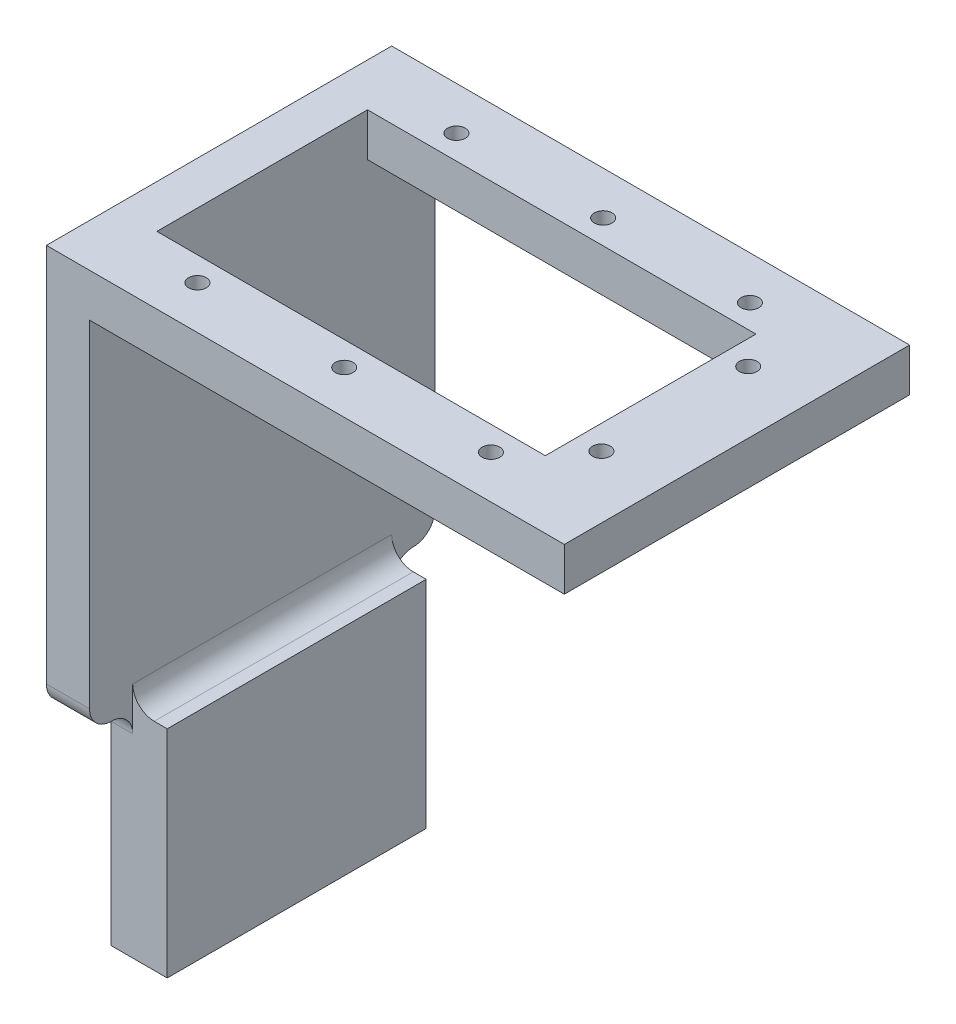
ISO-10303-21;
HEADER;
FILE_DESCRIPTION(('STEP AP214'),'2;1');
FILE_NAME('part.step','',(''),(''),'','','');
FILE_SCHEMA(('AUTOMOTIVE_DESIGN { 1 0 10303 214 1 1 1 1 }'));
ENDSEC;
DATA;
#1=APPLICATION_CONTEXT('core data for automotive mechanical design processes');
#2=APPLICATION_PROTOCOL_DEFINITION('international standard','automotive_design',2000,#1);
#3=PRODUCT_CONTEXT('',#1,'mechanical');
#4=PRODUCT('Part','Part','',(#3));
#5=PRODUCT_RELATED_PRODUCT_CATEGORY('part','',(#4));
#6=PRODUCT_DEFINITION_FORMATION('','',#4);
#7=PRODUCT_DEFINITION_CONTEXT('part definition',#1,'design');
#8=PRODUCT_DEFINITION('design','',#6,#7);
#9=PRODUCT_DEFINITION_SHAPE('','',#8);
#10=(LENGTH_UNIT() NAMED_UNIT(*) SI_UNIT(.MILLI.,.METRE.));
#11=(NAMED_UNIT(*) PLANE_ANGLE_UNIT() SI_UNIT($,.RADIAN.));
#12=(NAMED_UNIT(*) SI_UNIT($,.STERADIAN.) SOLID_ANGLE_UNIT());
#13=UNCERTAINTY_MEASURE_WITH_UNIT(LENGTH_MEASURE(1.E-05),#10,'distance_accuracy_value','');
#14=(GEOMETRIC_REPRESENTATION_CONTEXT(3) GLOBAL_UNCERTAINTY_ASSIGNED_CONTEXT((#13)) GLOBAL_UNIT_ASSIGNED_CONTEXT((#10,
#11,#12)) REPRESENTATION_CONTEXT('',''));
#15=CARTESIAN_POINT('',(0.,0.,0.));
#16=DIRECTION('',(0.,0.,1.));
#17=DIRECTION('',(1.,0.,0.));
#18=AXIS2_PLACEMENT_3D('',#15,#16,#17);
#19=CARTESIAN_POINT('',(0.,5.,0.));
#20=DIRECTION('',(0.,-1.,0.));
#21=DIRECTION('',(0.,0.,-1.));
#22=AXIS2_PLACEMENT_3D('',#19,#20,#21);
#23=PLANE('',#22);
#24=CARTESIAN_POINT('',(46.5,5.,-35.));
#25=DIRECTION('',(0.,-1.,0.));
#26=DIRECTION('',(0.,0.,-1.));
#27=AXIS2_PLACEMENT_3D('',#24,#25,#26);
#28=CIRCLE('',#27,1.025);
#29=CARTESIAN_POINT('',(46.5,5.,-36.025));
#30=VERTEX_POINT('',#29);
#31=EDGE_CURVE('E321',#30,#30,#28,.F.);
#32=ORIENTED_EDGE('',*,*,#31,.F.);
#33=EDGE_LOOP('',(#32));
#34=FACE_BOUND('',#33,.T.);
#35=CARTESIAN_POINT('',(29.5,5.,-35.));
#36=DIRECTION('',(0.,-1.,0.));
#37=DIRECTION('',(0.,0.,-1.));
#38=AXIS2_PLACEMENT_3D('',#35,#36,#37);
#39=CIRCLE('',#38,1.025);
#40=CARTESIAN_POINT('',(29.5,5.,-36.025));
#41=VERTEX_POINT('',#40);
#42=EDGE_CURVE('E506',#41,#41,#39,.F.);
#43=ORIENTED_EDGE('',*,*,#42,.F.);
#44=EDGE_LOOP('',(#43));
#45=FACE_BOUND('',#44,.T.);
#46=CARTESIAN_POINT('',(12.5,5.,-35.));
#47=DIRECTION('',(0.,-1.,0.));
#48=DIRECTION('',(0.,0.,-1.));
#49=AXIS2_PLACEMENT_3D('',#46,#47,#48);
#50=CIRCLE('',#49,1.02499999999999);
#51=CARTESIAN_POINT('',(12.5,5.,-36.025));
#52=VERTEX_POINT('',#51);
#53=EDGE_CURVE('E512',#52,#52,#50,.F.);
#54=ORIENTED_EDGE('',*,*,#53,.F.);
#55=EDGE_LOOP('',(#54));
#56=FACE_BOUND('',#55,.T.);
#57=CARTESIAN_POINT('',(12.5,5.,-4.9999999999998));
#58=DIRECTION('',(0.,-1.,0.));
#59=DIRECTION('',(0.,0.,-1.));
#60=AXIS2_PLACEMENT_3D('',#57,#58,#59);
#61=CIRCLE('',#60,1.02499999999999);
#62=CARTESIAN_POINT('',(12.5,5.,-6.02499999999979));
#63=VERTEX_POINT('',#62);
#64=EDGE_CURVE('E487',#63,#63,#61,.F.);
#65=ORIENTED_EDGE('',*,*,#64,.F.);
#66=EDGE_LOOP('',(#65));
#67=FACE_BOUND('',#66,.T.);
#68=CARTESIAN_POINT('',(29.5,5.,-4.99999999999978));
#69=DIRECTION('',(0.,-1.,0.));
#70=DIRECTION('',(0.,0.,-1.));
#71=AXIS2_PLACEMENT_3D('',#68,#69,#70);
#72=CIRCLE('',#71,1.025);
#73=CARTESIAN_POINT('',(29.5,5.,-6.02499999999978));
#74=VERTEX_POINT('',#73);
#75=EDGE_CURVE('E482',#74,#74,#72,.F.);
#76=ORIENTED_EDGE('',*,*,#75,.F.);
#77=EDGE_LOOP('',(#76));
#78=FACE_BOUND('',#77,.T.);
#79=CARTESIAN_POINT('',(46.5,5.,-4.99999999999978));
#80=DIRECTION('',(0.,-1.,0.));
#81=DIRECTION('',(0.,0.,-1.));
#82=AXIS2_PLACEMENT_3D('',#79,#80,#81);
#83=CIRCLE('',#82,1.025);
#84=CARTESIAN_POINT('',(46.5,5.,-6.02499999999977));
#85=VERTEX_POINT('',#84);
#86=EDGE_CURVE('E489',#85,#85,#83,.F.);
#87=ORIENTED_EDGE('',*,*,#86,.F.);
#88=EDGE_LOOP('',(#87));
#89=FACE_BOUND('',#88,.T.);
#90=CARTESIAN_POINT('',(52.8,5.,-11.4999999999998));
#91=DIRECTION('',(0.,-1.,0.));
#92=DIRECTION('',(0.,0.,-1.));
#93=AXIS2_PLACEMENT_3D('',#90,#91,#92);
#94=CIRCLE('',#93,1.025);
#95=CARTESIAN_POINT('',(52.8,5.,-12.5249999999998));
#96=VERTEX_POINT('',#95);
#97=EDGE_CURVE('E495',#96,#96,#94,.F.);
#98=ORIENTED_EDGE('',*,*,#97,.F.);
#99=EDGE_LOOP('',(#98));
#100=FACE_BOUND('',#99,.T.);
#101=CARTESIAN_POINT('',(52.8,5.,-28.5));
#102=DIRECTION('',(0.,-1.,0.));
#103=DIRECTION('',(0.,0.,-1.));
#104=AXIS2_PLACEMENT_3D('',#101,#102,#103);
#105=CIRCLE('',#104,1.025);
#106=CARTESIAN_POINT('',(52.8,5.,-29.525));
#107=VERTEX_POINT('',#106);
#108=EDGE_CURVE('E310',#107,#107,#105,.F.);
#109=ORIENTED_EDGE('',*,*,#108,.F.);
#110=EDGE_LOOP('',(#109));
#111=FACE_BOUND('',#110,.T.);
#112=DIRECTION('',(0.,0.,1.));
#113=VECTOR('',#112,1.);
#114=CARTESIAN_POINT('',(0.,5.,0.));
#115=LINE('',#114,#113);
#116=CARTESIAN_POINT('',(0.,5.,-40.));
#117=VERTEX_POINT('',#116);
#118=CARTESIAN_POINT('',(0.,5.,0.));
#119=VERTEX_POINT('',#118);
#120=EDGE_CURVE('E236',#117,#119,#115,.T.);
#121=ORIENTED_EDGE('',*,*,#120,.T.);
#122=DIRECTION('',(1.,0.,0.));
#123=VECTOR('',#122,1.);
#124=CARTESIAN_POINT('',(0.,5.,0.));
#125=LINE('',#124,#123);
#126=CARTESIAN_POINT('',(60.,5.,0.));
#127=VERTEX_POINT('',#126);
#128=EDGE_CURVE('E239',#119,#127,#125,.T.);
#129=ORIENTED_EDGE('',*,*,#128,.T.);
#130=DIRECTION('',(0.,0.,-1.));
#131=VECTOR('',#130,1.);
#132=CARTESIAN_POINT('',(60.,5.,0.));
#133=LINE('',#132,#131);
#134=CARTESIAN_POINT('',(60.,5.,-40.));
#135=VERTEX_POINT('',#134);
#136=EDGE_CURVE('E242',#127,#135,#133,.T.);
#137=ORIENTED_EDGE('',*,*,#136,.T.);
#138=DIRECTION('',(-1.,0.,0.));
#139=VECTOR('',#138,1.);
#140=CARTESIAN_POINT('',(0.,5.,-40.));
#141=LINE('',#140,#139);
#142=EDGE_CURVE('E244',#135,#117,#141,.T.);
#143=ORIENTED_EDGE('',*,*,#142,.T.);
#144=EDGE_LOOP('',(#121,#129,#137,#143));
#145=FACE_BOUND('',#144,.T.);
#146=DIRECTION('',(0.,0.,1.));
#147=VECTOR('',#146,1.);
#148=CARTESIAN_POINT('',(5.,5.,-7.8));
#149=LINE('',#148,#147);
#150=CARTESIAN_POINT('',(5.,5.,-32.2));
#151=VERTEX_POINT('',#150);
#152=CARTESIAN_POINT('',(5.,5.,-7.8));
#153=VERTEX_POINT('',#152);
#154=EDGE_CURVE('E209',#151,#153,#149,.T.);
#155=ORIENTED_EDGE('',*,*,#154,.F.);
#156=DIRECTION('',(-1.,0.,0.));
#157=VECTOR('',#156,1.);
#158=CARTESIAN_POINT('',(5.,5.,-32.2));
#159=LINE('',#158,#157);
#160=CARTESIAN_POINT('',(50.,5.,-32.2));
#161=VERTEX_POINT('',#160);
#162=EDGE_CURVE('E217',#161,#151,#159,.T.);
#163=ORIENTED_EDGE('',*,*,#162,.F.);
#164=DIRECTION('',(0.,0.,-1.));
#165=VECTOR('',#164,1.);
#166=CARTESIAN_POINT('',(50.,5.,-7.8));
#167=LINE('',#166,#165);
#168=CARTESIAN_POINT('',(50.,5.,-7.8));
#169=VERTEX_POINT('',#168);
#170=EDGE_CURVE('E214',#169,#161,#167,.T.);
#171=ORIENTED_EDGE('',*,*,#170,.F.);
#172=DIRECTION('',(1.,0.,0.));
#173=VECTOR('',#172,1.);
#174=CARTESIAN_POINT('',(5.,5.,-7.8));
#175=LINE('',#174,#173);
#176=EDGE_CURVE('E211',#153,#169,#175,.T.);
#177=ORIENTED_EDGE('',*,*,#176,.F.);
#178=EDGE_LOOP('',(#155,#163,#171,#177));
#179=FACE_BOUND('',#178,.T.);
#180=ADVANCED_FACE('F39',(#34,#45,#56,#67,#78,#89,#100,#111,#145,#179),#23,.F.);
#181=CARTESIAN_POINT('',(0.,0.,0.));
#182=DIRECTION('',(0.,-1.,0.));
#183=DIRECTION('',(0.,0.,-1.));
#184=AXIS2_PLACEMENT_3D('',#181,#182,#183);
#185=PLANE('',#184);
#186=CARTESIAN_POINT('',(46.5,0.,-35.));
#187=DIRECTION('',(0.,-1.,0.));
#188=DIRECTION('',(0.,0.,-1.));
#189=AXIS2_PLACEMENT_3D('',#186,#187,#188);
#190=CIRCLE('',#189,1.025);
#191=CARTESIAN_POINT('',(46.5,0.,-36.025));
#192=VERTEX_POINT('',#191);
#193=EDGE_CURVE('E503',#192,#192,#190,.T.);
#194=ORIENTED_EDGE('',*,*,#193,.F.);
#195=EDGE_LOOP('',(#194));
#196=FACE_BOUND('',#195,.T.);
#197=CARTESIAN_POINT('',(29.5,0.,-35.));
#198=DIRECTION('',(0.,-1.,0.));
#199=DIRECTION('',(0.,0.,-1.));
#200=AXIS2_PLACEMENT_3D('',#197,#198,#199);
#201=CIRCLE('',#200,1.025);
#202=CARTESIAN_POINT('',(29.5,0.,-36.025));
#203=VERTEX_POINT('',#202);
#204=EDGE_CURVE('E509',#203,#203,#201,.T.);
#205=ORIENTED_EDGE('',*,*,#204,.F.);
#206=EDGE_LOOP('',(#205));
#207=FACE_BOUND('',#206,.T.);
#208=CARTESIAN_POINT('',(12.5,0.,-35.));
#209=DIRECTION('',(0.,-1.,0.));
#210=DIRECTION('',(0.,0.,-1.));
#211=AXIS2_PLACEMENT_3D('',#208,#209,#210);
#212=CIRCLE('',#211,1.02499999999999);
#213=CARTESIAN_POINT('',(12.5,0.,-36.025));
#214=VERTEX_POINT('',#213);
#215=EDGE_CURVE('E515',#214,#214,#212,.T.);
#216=ORIENTED_EDGE('',*,*,#215,.F.);
#217=EDGE_LOOP('',(#216));
#218=FACE_BOUND('',#217,.T.);
#219=CARTESIAN_POINT('',(12.5,0.,-4.9999999999998));
#220=DIRECTION('',(0.,-1.,0.));
#221=DIRECTION('',(0.,0.,1.));
#222=AXIS2_PLACEMENT_3D('',#219,#220,#221);
#223=CIRCLE('',#222,1.02499999999999);
#224=CARTESIAN_POINT('',(12.5,0.,-3.9749999999998));
#225=VERTEX_POINT('',#224);
#226=EDGE_CURVE('E484',#225,#225,#223,.T.);
#227=ORIENTED_EDGE('',*,*,#226,.F.);
#228=EDGE_LOOP('',(#227));
#229=FACE_BOUND('',#228,.T.);
#230=CARTESIAN_POINT('',(29.5,0.,-4.99999999999978));
#231=DIRECTION('',(0.,-1.,0.));
#232=DIRECTION('',(0.,0.,1.));
#233=AXIS2_PLACEMENT_3D('',#230,#231,#232);
#234=CIRCLE('',#233,1.025);
#235=CARTESIAN_POINT('',(29.5,0.,-3.97499999999979));
#236=VERTEX_POINT('',#235);
#237=EDGE_CURVE('E479',#236,#236,#234,.T.);
#238=ORIENTED_EDGE('',*,*,#237,.F.);
#239=EDGE_LOOP('',(#238));
#240=FACE_BOUND('',#239,.T.);
#241=CARTESIAN_POINT('',(46.5,0.,-4.99999999999978));
#242=DIRECTION('',(0.,-1.,0.));
#243=DIRECTION('',(0.,0.,1.));
#244=AXIS2_PLACEMENT_3D('',#241,#242,#243);
#245=CIRCLE('',#244,1.025);
#246=CARTESIAN_POINT('',(46.5,0.,-3.97499999999978));
#247=VERTEX_POINT('',#246);
#248=EDGE_CURVE('E492',#247,#247,#245,.T.);
#249=ORIENTED_EDGE('',*,*,#248,.F.);
#250=EDGE_LOOP('',(#249));
#251=FACE_BOUND('',#250,.T.);
#252=CARTESIAN_POINT('',(52.8,0.,-11.4999999999998));
#253=DIRECTION('',(0.,-1.,0.));
#254=DIRECTION('',(0.,0.,1.));
#255=AXIS2_PLACEMENT_3D('',#252,#253,#254);
#256=CIRCLE('',#255,1.025);
#257=CARTESIAN_POINT('',(52.8,0.,-10.4749999999998));
#258=VERTEX_POINT('',#257);
#259=EDGE_CURVE('E498',#258,#258,#256,.T.);
#260=ORIENTED_EDGE('',*,*,#259,.F.);
#261=EDGE_LOOP('',(#260));
#262=FACE_BOUND('',#261,.T.);
#263=CARTESIAN_POINT('',(52.8,0.,-28.5));
#264=DIRECTION('',(0.,-1.,0.));
#265=DIRECTION('',(0.,0.,-1.));
#266=AXIS2_PLACEMENT_3D('',#263,#264,#265);
#267=CIRCLE('',#266,1.025);
#268=CARTESIAN_POINT('',(52.8,0.,-29.525));
#269=VERTEX_POINT('',#268);
#270=EDGE_CURVE('E316',#269,#269,#267,.T.);
#271=ORIENTED_EDGE('',*,*,#270,.F.);
#272=EDGE_LOOP('',(#271));
#273=FACE_BOUND('',#272,.T.);
#274=DIRECTION('',(0.,0.,1.));
#275=VECTOR('',#274,1.);
#276=CARTESIAN_POINT('',(5.,0.,-40.));
#277=LINE('',#276,#275);
#278=CARTESIAN_POINT('',(5.,0.,-40.));
#279=VERTEX_POINT('',#278);
#280=CARTESIAN_POINT('',(5.,0.,-32.2));
#281=VERTEX_POINT('',#280);
#282=EDGE_CURVE('E194',#279,#281,#277,.T.);
#283=ORIENTED_EDGE('',*,*,#282,.F.);
#284=DIRECTION('',(-1.,0.,0.));
#285=VECTOR('',#284,1.);
#286=CARTESIAN_POINT('',(0.,0.,-40.));
#287=LINE('',#286,#285);
#288=CARTESIAN_POINT('',(60.,0.,-40.));
#289=VERTEX_POINT('',#288);
#290=EDGE_CURVE('E240',#289,#279,#287,.T.);
#291=ORIENTED_EDGE('',*,*,#290,.F.);
#292=DIRECTION('',(0.,0.,-1.));
#293=VECTOR('',#292,1.);
#294=CARTESIAN_POINT('',(60.,0.,0.));
#295=LINE('',#294,#293);
#296=CARTESIAN_POINT('',(60.,0.,0.));
#297=VERTEX_POINT('',#296);
#298=EDGE_CURVE('E248',#297,#289,#295,.T.);
#299=ORIENTED_EDGE('',*,*,#298,.F.);
#300=DIRECTION('',(1.,0.,0.));
#301=VECTOR('',#300,1.);
#302=CARTESIAN_POINT('',(0.,0.,0.));
#303=LINE('',#302,#301);
#304=CARTESIAN_POINT('',(5.,0.,0.));
#305=VERTEX_POINT('',#304);
#306=EDGE_CURVE('E235',#305,#297,#303,.T.);
#307=ORIENTED_EDGE('',*,*,#306,.F.);
#308=CARTESIAN_POINT('',(5.,0.,-7.8));
#309=VERTEX_POINT('',#308);
#310=EDGE_CURVE('E198',#309,#305,#277,.T.);
#311=ORIENTED_EDGE('',*,*,#310,.F.);
#312=DIRECTION('',(1.,0.,0.));
#313=VECTOR('',#312,1.);
#314=CARTESIAN_POINT('',(5.,0.,-7.8));
#315=LINE('',#314,#313);
#316=CARTESIAN_POINT('',(50.,0.,-7.8));
#317=VERTEX_POINT('',#316);
#318=EDGE_CURVE('E208',#309,#317,#315,.T.);
#319=ORIENTED_EDGE('',*,*,#318,.T.);
#320=DIRECTION('',(0.,0.,-1.));
#321=VECTOR('',#320,1.);
#322=CARTESIAN_POINT('',(50.,0.,-7.8));
#323=LINE('',#322,#321);
#324=CARTESIAN_POINT('',(50.,0.,-32.2));
#325=VERTEX_POINT('',#324);
#326=EDGE_CURVE('E222',#317,#325,#323,.T.);
#327=ORIENTED_EDGE('',*,*,#326,.T.);
#328=DIRECTION('',(-1.,0.,0.));
#329=VECTOR('',#328,1.);
#330=CARTESIAN_POINT('',(5.,0.,-32.2));
#331=LINE('',#330,#329);
#332=EDGE_CURVE('E212',#325,#281,#331,.T.);
#333=ORIENTED_EDGE('',*,*,#332,.T.);
#334=EDGE_LOOP('',(#283,#291,#299,#307,#311,#319,#327,#333));
#335=FACE_BOUND('',#334,.T.);
#336=ADVANCED_FACE('F378',(#196,#207,#218,#229,#240,#251,#262,#273,#335),#185,.T.);
#337=CARTESIAN_POINT('',(0.,5.,0.));
#338=DIRECTION('',(1.,0.,0.));
#339=DIRECTION('',(0.,0.,-1.));
#340=AXIS2_PLACEMENT_3D('',#337,#338,#339);
#341=PLANE('',#340);
#342=DIRECTION('',(0.,0.,-1.));
#343=VECTOR('',#342,1.);
#344=CARTESIAN_POINT('',(0.,-41.5,-40.));
#345=LINE('',#344,#343);
#346=CARTESIAN_POINT('',(0.,-41.5,-2.5));
#347=VERTEX_POINT('',#346);
#348=CARTESIAN_POINT('',(0.,-41.5,-37.5));
#349=VERTEX_POINT('',#348);
#350=EDGE_CURVE('E57',#347,#349,#345,.T.);
#351=ORIENTED_EDGE('',*,*,#350,.F.);
#352=CARTESIAN_POINT('',(0.,-39.,-2.5));
#353=DIRECTION('',(1.,0.,0.));
#354=DIRECTION('',(0.,0.,-1.));
#355=AXIS2_PLACEMENT_3D('',#352,#353,#354);
#356=CIRCLE('',#355,2.5);
#357=CARTESIAN_POINT('',(0.,-39.,0.));
#358=VERTEX_POINT('',#357);
#359=EDGE_CURVE('E286',#347,#358,#356,.F.);
#360=ORIENTED_EDGE('',*,*,#359,.T.);
#361=DIRECTION('',(0.,-1.,0.));
#362=VECTOR('',#361,1.);
#363=CARTESIAN_POINT('',(0.,5.,0.));
#364=LINE('',#363,#362);
#365=EDGE_CURVE('E260',#119,#358,#364,.T.);
#366=ORIENTED_EDGE('',*,*,#365,.F.);
#367=ORIENTED_EDGE('',*,*,#120,.F.);
#368=DIRECTION('',(0.,-1.,0.));
#369=VECTOR('',#368,1.);
#370=CARTESIAN_POINT('',(0.,5.,-40.));
#371=LINE('',#370,#369);
#372=CARTESIAN_POINT('',(0.,-39.,-40.));
#373=VERTEX_POINT('',#372);
#374=EDGE_CURVE('E246',#117,#373,#371,.T.);
#375=ORIENTED_EDGE('',*,*,#374,.T.);
#376=CARTESIAN_POINT('',(0.,-39.,-37.5));
#377=DIRECTION('',(1.,0.,0.));
#378=DIRECTION('',(0.,0.,-1.));
#379=AXIS2_PLACEMENT_3D('',#376,#377,#378);
#380=CIRCLE('',#379,2.5);
#381=EDGE_CURVE('E284',#373,#349,#380,.F.);
#382=ORIENTED_EDGE('',*,*,#381,.T.);
#383=EDGE_LOOP('',(#351,#360,#366,#367,#375,#382));
#384=FACE_BOUND('',#383,.T.);
#385=ADVANCED_FACE('F366',(#384),#341,.F.);
#386=CARTESIAN_POINT('',(0.,5.,0.));
#387=DIRECTION('',(0.,0.,-1.));
#388=DIRECTION('',(-1.,0.,0.));
#389=AXIS2_PLACEMENT_3D('',#386,#387,#388);
#390=PLANE('',#389);
#391=ORIENTED_EDGE('',*,*,#365,.T.);
#392=DIRECTION('',(-1.,0.,0.));
#393=VECTOR('',#392,1.);
#394=CARTESIAN_POINT('',(0.,-39.,0.));
#395=LINE('',#394,#393);
#396=CARTESIAN_POINT('',(5.,-39.,0.));
#397=VERTEX_POINT('',#396);
#398=EDGE_CURVE('E288',#358,#397,#395,.F.);
#399=ORIENTED_EDGE('',*,*,#398,.T.);
#400=DIRECTION('',(0.,1.,0.));
#401=VECTOR('',#400,1.);
#402=CARTESIAN_POINT('',(5.,-41.5,0.));
#403=LINE('',#402,#401);
#404=EDGE_CURVE('E203',#397,#305,#403,.T.);
#405=ORIENTED_EDGE('',*,*,#404,.T.);
#406=ORIENTED_EDGE('',*,*,#306,.T.);
#407=DIRECTION('',(0.,-1.,0.));
#408=VECTOR('',#407,1.);
#409=CARTESIAN_POINT('',(60.,5.,0.));
#410=LINE('',#409,#408);
#411=EDGE_CURVE('E257',#127,#297,#410,.T.);
#412=ORIENTED_EDGE('',*,*,#411,.F.);
#413=ORIENTED_EDGE('',*,*,#128,.F.);
#414=EDGE_LOOP('',(#391,#399,#405,#406,#412,#413));
#415=FACE_BOUND('',#414,.T.);
#416=ADVANCED_FACE('F400',(#415),#390,.F.);
#417=CARTESIAN_POINT('',(60.,5.,0.));
#418=DIRECTION('',(-1.,0.,0.));
#419=DIRECTION('',(0.,0.,1.));
#420=AXIS2_PLACEMENT_3D('',#417,#418,#419);
#421=PLANE('',#420);
#422=ORIENTED_EDGE('',*,*,#298,.T.);
#423=DIRECTION('',(0.,-1.,0.));
#424=VECTOR('',#423,1.);
#425=CARTESIAN_POINT('',(60.,5.,-40.));
#426=LINE('',#425,#424);
#427=EDGE_CURVE('E254',#135,#289,#426,.T.);
#428=ORIENTED_EDGE('',*,*,#427,.F.);
#429=ORIENTED_EDGE('',*,*,#136,.F.);
#430=ORIENTED_EDGE('',*,*,#411,.T.);
#431=EDGE_LOOP('',(#422,#428,#429,#430));
#432=FACE_BOUND('',#431,.T.);
#433=ADVANCED_FACE('F401',(#432),#421,.F.);
#434=CARTESIAN_POINT('',(0.,5.,-40.));
#435=DIRECTION('',(0.,0.,1.));
#436=DIRECTION('',(1.,0.,0.));
#437=AXIS2_PLACEMENT_3D('',#434,#435,#436);
#438=PLANE('',#437);
#439=DIRECTION('',(0.,1.,0.));
#440=VECTOR('',#439,1.);
#441=CARTESIAN_POINT('',(5.,-41.5,-40.));
#442=LINE('',#441,#440);
#443=CARTESIAN_POINT('',(5.,-39.,-40.));
#444=VERTEX_POINT('',#443);
#445=EDGE_CURVE('E206',#444,#279,#442,.T.);
#446=ORIENTED_EDGE('',*,*,#445,.F.);
#447=DIRECTION('',(1.,0.,0.));
#448=VECTOR('',#447,1.);
#449=CARTESIAN_POINT('',(0.,-39.,-40.));
#450=LINE('',#449,#448);
#451=EDGE_CURVE('E294',#444,#373,#450,.F.);
#452=ORIENTED_EDGE('',*,*,#451,.T.);
#453=ORIENTED_EDGE('',*,*,#374,.F.);
#454=ORIENTED_EDGE('',*,*,#142,.F.);
#455=ORIENTED_EDGE('',*,*,#427,.T.);
#456=ORIENTED_EDGE('',*,*,#290,.T.);
#457=EDGE_LOOP('',(#446,#452,#453,#454,#455,#456));
#458=FACE_BOUND('',#457,.T.);
#459=ADVANCED_FACE('F363',(#458),#438,.F.);
#460=CARTESIAN_POINT('',(5.,5.,-7.8));
#461=DIRECTION('',(1.,0.,0.));
#462=DIRECTION('',(0.,0.,-1.));
#463=AXIS2_PLACEMENT_3D('',#460,#461,#462);
#464=PLANE('',#463);
#465=ORIENTED_EDGE('',*,*,#404,.F.);
#466=CARTESIAN_POINT('',(5.,-39.,-2.5));
#467=DIRECTION('',(1.,0.,0.));
#468=DIRECTION('',(0.,0.,-1.));
#469=AXIS2_PLACEMENT_3D('',#466,#467,#468);
#470=CIRCLE('',#469,2.5);
#471=CARTESIAN_POINT('',(5.,-41.5,-2.5));
#472=VERTEX_POINT('',#471);
#473=EDGE_CURVE('E292',#397,#472,#470,.T.);
#474=ORIENTED_EDGE('',*,*,#473,.T.);
#475=CARTESIAN_POINT('',(5.,-44.,-2.5));
#476=DIRECTION('',(1.,0.,0.));
#477=DIRECTION('',(0.,0.,-1.));
#478=AXIS2_PLACEMENT_3D('',#475,#476,#477);
#479=CIRCLE('',#478,2.5);
#480=CARTESIAN_POINT('',(5.,-44.,-5.));
#481=VERTEX_POINT('',#480);
#482=EDGE_CURVE('E298',#472,#481,#479,.F.);
#483=ORIENTED_EDGE('',*,*,#482,.T.);
#484=DIRECTION('',(0.,1.,0.));
#485=VECTOR('',#484,1.);
#486=CARTESIAN_POINT('',(5.,5.,-5.));
#487=LINE('',#486,#485);
#488=CARTESIAN_POINT('',(5.,-39.,-5.));
#489=VERTEX_POINT('',#488);
#490=EDGE_CURVE('E271',#481,#489,#487,.T.);
#491=ORIENTED_EDGE('',*,*,#490,.T.);
#492=DIRECTION('',(0.,0.,1.));
#493=VECTOR('',#492,1.);
#494=CARTESIAN_POINT('',(5.,-39.,-35.));
#495=LINE('',#494,#493);
#496=CARTESIAN_POINT('',(5.,-39.,-35.));
#497=VERTEX_POINT('',#496);
#498=EDGE_CURVE('E268',#489,#497,#495,.F.);
#499=ORIENTED_EDGE('',*,*,#498,.T.);
#500=DIRECTION('',(0.,-1.,0.));
#501=VECTOR('',#500,1.);
#502=CARTESIAN_POINT('',(5.,5.,-35.));
#503=LINE('',#502,#501);
#504=CARTESIAN_POINT('',(5.,-44.,-35.));
#505=VERTEX_POINT('',#504);
#506=EDGE_CURVE('E266',#497,#505,#503,.T.);
#507=ORIENTED_EDGE('',*,*,#506,.T.);
#508=CARTESIAN_POINT('',(5.,-44.,-37.5));
#509=DIRECTION('',(1.,0.,0.));
#510=DIRECTION('',(0.,0.,-1.));
#511=AXIS2_PLACEMENT_3D('',#508,#509,#510);
#512=CIRCLE('',#511,2.5);
#513=CARTESIAN_POINT('',(5.,-41.5,-37.5));
#514=VERTEX_POINT('',#513);
#515=EDGE_CURVE('E49',#505,#514,#512,.F.);
#516=ORIENTED_EDGE('',*,*,#515,.T.);
#517=CARTESIAN_POINT('',(5.,-39.,-37.5));
#518=DIRECTION('',(1.,0.,0.));
#519=DIRECTION('',(0.,0.,-1.));
#520=AXIS2_PLACEMENT_3D('',#517,#518,#519);
#521=CIRCLE('',#520,2.5);
#522=EDGE_CURVE('E290',#514,#444,#521,.T.);
#523=ORIENTED_EDGE('',*,*,#522,.T.);
#524=ORIENTED_EDGE('',*,*,#445,.T.);
#525=ORIENTED_EDGE('',*,*,#282,.T.);
#526=DIRECTION('',(0.,-1.,0.));
#527=VECTOR('',#526,1.);
#528=CARTESIAN_POINT('',(5.,5.,-32.2));
#529=LINE('',#528,#527);
#530=EDGE_CURVE('E219',#151,#281,#529,.T.);
#531=ORIENTED_EDGE('',*,*,#530,.F.);
#532=ORIENTED_EDGE('',*,*,#154,.T.);
#533=DIRECTION('',(0.,-1.,0.));
#534=VECTOR('',#533,1.);
#535=CARTESIAN_POINT('',(5.,5.,-7.8));
#536=LINE('',#535,#534);
#537=EDGE_CURVE('E232',#153,#309,#536,.T.);
#538=ORIENTED_EDGE('',*,*,#537,.T.);
#539=ORIENTED_EDGE('',*,*,#310,.T.);
#540=EDGE_LOOP('',(#465,#474,#483,#491,#499,#507,#516,#523,#524,#525,#531,#532,#538,#539));
#541=FACE_BOUND('',#540,.T.);
#542=ADVANCED_FACE('F348',(#541),#464,.T.);
#543=CARTESIAN_POINT('',(5.,5.,-7.8));
#544=DIRECTION('',(0.,0.,-1.));
#545=DIRECTION('',(-1.,0.,0.));
#546=AXIS2_PLACEMENT_3D('',#543,#544,#545);
#547=PLANE('',#546);
#548=ORIENTED_EDGE('',*,*,#318,.F.);
#549=ORIENTED_EDGE('',*,*,#537,.F.);
#550=ORIENTED_EDGE('',*,*,#176,.T.);
#551=DIRECTION('',(0.,-1.,0.));
#552=VECTOR('',#551,1.);
#553=CARTESIAN_POINT('',(50.,5.,-7.8));
#554=LINE('',#553,#552);
#555=EDGE_CURVE('E230',#169,#317,#554,.T.);
#556=ORIENTED_EDGE('',*,*,#555,.T.);
#557=EDGE_LOOP('',(#548,#549,#550,#556));
#558=FACE_BOUND('',#557,.T.);
#559=ADVANCED_FACE('F391',(#558),#547,.T.);
#560=CARTESIAN_POINT('',(50.,5.,-7.8));
#561=DIRECTION('',(-1.,0.,0.));
#562=DIRECTION('',(0.,0.,1.));
#563=AXIS2_PLACEMENT_3D('',#560,#561,#562);
#564=PLANE('',#563);
#565=ORIENTED_EDGE('',*,*,#326,.F.);
#566=ORIENTED_EDGE('',*,*,#555,.F.);
#567=ORIENTED_EDGE('',*,*,#170,.T.);
#568=DIRECTION('',(0.,-1.,0.));
#569=VECTOR('',#568,1.);
#570=CARTESIAN_POINT('',(50.,5.,-32.2));
#571=LINE('',#570,#569);
#572=EDGE_CURVE('E228',#161,#325,#571,.T.);
#573=ORIENTED_EDGE('',*,*,#572,.T.);
#574=EDGE_LOOP('',(#565,#566,#567,#573));
#575=FACE_BOUND('',#574,.T.);
#576=ADVANCED_FACE('F394',(#575),#564,.T.);
#577=CARTESIAN_POINT('',(5.,5.,-32.2));
#578=DIRECTION('',(0.,0.,1.));
#579=DIRECTION('',(1.,0.,0.));
#580=AXIS2_PLACEMENT_3D('',#577,#578,#579);
#581=PLANE('',#580);
#582=ORIENTED_EDGE('',*,*,#332,.F.);
#583=ORIENTED_EDGE('',*,*,#572,.F.);
#584=ORIENTED_EDGE('',*,*,#162,.T.);
#585=ORIENTED_EDGE('',*,*,#530,.T.);
#586=EDGE_LOOP('',(#582,#583,#584,#585));
#587=FACE_BOUND('',#586,.T.);
#588=ADVANCED_FACE('F427',(#587),#581,.T.);
#589=CARTESIAN_POINT('',(2.5,-66.5,-35.));
#590=DIRECTION('',(1.,0.,0.));
#591=DIRECTION('',(0.,0.,-1.));
#592=AXIS2_PLACEMENT_3D('',#589,#590,#591);
#593=PLANE('',#592);
#594=DIRECTION('',(0.,1.,0.));
#595=VECTOR('',#594,1.);
#596=CARTESIAN_POINT('',(2.5,-66.5,-5.));
#597=LINE('',#596,#595);
#598=CARTESIAN_POINT('',(2.5,-66.5,-5.));
#599=VERTEX_POINT('',#598);
#600=CARTESIAN_POINT('',(2.5,-44.,-5.));
#601=VERTEX_POINT('',#600);
#602=EDGE_CURVE('E326',#599,#601,#597,.T.);
#603=ORIENTED_EDGE('',*,*,#602,.T.);
#604=DIRECTION('',(0.,0.,-1.));
#605=VECTOR('',#604,1.);
#606=CARTESIAN_POINT('',(2.5,-44.,-35.));
#607=LINE('',#606,#605);
#608=CARTESIAN_POINT('',(2.5,-44.,-35.));
#609=VERTEX_POINT('',#608);
#610=EDGE_CURVE('E193',#601,#609,#607,.T.);
#611=ORIENTED_EDGE('',*,*,#610,.T.);
#612=DIRECTION('',(0.,1.,0.));
#613=VECTOR('',#612,1.);
#614=CARTESIAN_POINT('',(2.5,-66.5,-35.));
#615=LINE('',#614,#613);
#616=CARTESIAN_POINT('',(2.5,-66.5,-35.));
#617=VERTEX_POINT('',#616);
#618=EDGE_CURVE('E172',#617,#609,#615,.T.);
#619=ORIENTED_EDGE('',*,*,#618,.F.);
#620=DIRECTION('',(0.,0.,-1.));
#621=VECTOR('',#620,1.);
#622=CARTESIAN_POINT('',(2.5,-66.5,-35.));
#623=LINE('',#622,#621);
#624=EDGE_CURVE('E179',#599,#617,#623,.T.);
#625=ORIENTED_EDGE('',*,*,#624,.F.);
#626=EDGE_LOOP('',(#603,#611,#619,#625));
#627=FACE_BOUND('',#626,.T.);
#628=ADVANCED_FACE('F191',(#627),#593,.F.);
#629=CARTESIAN_POINT('',(2.5,-66.5,-35.));
#630=DIRECTION('',(0.,0.,1.));
#631=DIRECTION('',(1.,0.,0.));
#632=AXIS2_PLACEMENT_3D('',#629,#630,#631);
#633=PLANE('',#632);
#634=ORIENTED_EDGE('',*,*,#618,.T.);
#635=DIRECTION('',(1.,0.,0.));
#636=VECTOR('',#635,1.);
#637=CARTESIAN_POINT('',(5.,-44.,-35.));
#638=LINE('',#637,#636);
#639=EDGE_CURVE('E282',#609,#505,#638,.T.);
#640=ORIENTED_EDGE('',*,*,#639,.T.);
#641=ORIENTED_EDGE('',*,*,#506,.F.);
#642=CARTESIAN_POINT('',(7.5,-39.,-35.));
#643=DIRECTION('',(0.,0.,1.));
#644=DIRECTION('',(1.,0.,0.));
#645=AXIS2_PLACEMENT_3D('',#642,#643,#644);
#646=CIRCLE('',#645,2.5);
#647=CARTESIAN_POINT('',(7.5,-41.5,-35.));
#648=VERTEX_POINT('',#647);
#649=EDGE_CURVE('E277',#497,#648,#646,.T.);
#650=ORIENTED_EDGE('',*,*,#649,.T.);
#651=DIRECTION('',(1.,0.,0.));
#652=VECTOR('',#651,1.);
#653=CARTESIAN_POINT('',(2.5,-41.5,-35.));
#654=LINE('',#653,#652);
#655=CARTESIAN_POINT('',(9.,-41.5,-35.));
#656=VERTEX_POINT('',#655);
#657=EDGE_CURVE('E303',#648,#656,#654,.T.);
#658=ORIENTED_EDGE('',*,*,#657,.T.);
#659=DIRECTION('',(0.,1.,0.));
#660=VECTOR('',#659,1.);
#661=CARTESIAN_POINT('',(9.,-66.5,-35.));
#662=LINE('',#661,#660);
#663=CARTESIAN_POINT('',(9.,-66.5,-35.));
#664=VERTEX_POINT('',#663);
#665=EDGE_CURVE('E175',#664,#656,#662,.T.);
#666=ORIENTED_EDGE('',*,*,#665,.F.);
#667=DIRECTION('',(1.,0.,0.));
#668=VECTOR('',#667,1.);
#669=CARTESIAN_POINT('',(2.5,-66.5,-35.));
#670=LINE('',#669,#668);
#671=EDGE_CURVE('E167',#617,#664,#670,.T.);
#672=ORIENTED_EDGE('',*,*,#671,.F.);
#673=EDGE_LOOP('',(#634,#640,#641,#650,#658,#666,#672));
#674=FACE_BOUND('',#673,.T.);
#675=ADVANCED_FACE('F169',(#674),#633,.F.);
#676=CARTESIAN_POINT('',(9.,-66.5,-35.));
#677=DIRECTION('',(-1.,0.,0.));
#678=DIRECTION('',(0.,0.,1.));
#679=AXIS2_PLACEMENT_3D('',#676,#677,#678);
#680=PLANE('',#679);
#681=DIRECTION('',(0.,0.,1.));
#682=VECTOR('',#681,1.);
#683=CARTESIAN_POINT('',(9.,-41.5,-35.));
#684=LINE('',#683,#682);
#685=CARTESIAN_POINT('',(9.,-41.5,-5.));
#686=VERTEX_POINT('',#685);
#687=EDGE_CURVE('E307',#656,#686,#684,.T.);
#688=ORIENTED_EDGE('',*,*,#687,.T.);
#689=DIRECTION('',(0.,1.,0.));
#690=VECTOR('',#689,1.);
#691=CARTESIAN_POINT('',(9.,-66.5,-5.));
#692=LINE('',#691,#690);
#693=CARTESIAN_POINT('',(9.,-66.5,-5.));
#694=VERTEX_POINT('',#693);
#695=EDGE_CURVE('E199',#694,#686,#692,.T.);
#696=ORIENTED_EDGE('',*,*,#695,.F.);
#697=DIRECTION('',(0.,0.,1.));
#698=VECTOR('',#697,1.);
#699=CARTESIAN_POINT('',(9.,-66.5,-35.));
#700=LINE('',#699,#698);
#701=EDGE_CURVE('E178',#664,#694,#700,.T.);
#702=ORIENTED_EDGE('',*,*,#701,.F.);
#703=ORIENTED_EDGE('',*,*,#665,.T.);
#704=EDGE_LOOP('',(#688,#696,#702,#703));
#705=FACE_BOUND('',#704,.T.);
#706=ADVANCED_FACE('F434',(#705),#680,.F.);
#707=CARTESIAN_POINT('',(2.5,-66.5,-5.));
#708=DIRECTION('',(0.,0.,-1.));
#709=DIRECTION('',(-1.,0.,0.));
#710=AXIS2_PLACEMENT_3D('',#707,#708,#709);
#711=PLANE('',#710);
#712=ORIENTED_EDGE('',*,*,#490,.F.);
#713=DIRECTION('',(-1.,0.,0.));
#714=VECTOR('',#713,1.);
#715=CARTESIAN_POINT('',(0.,-44.,-5.));
#716=LINE('',#715,#714);
#717=EDGE_CURVE('E279',#481,#601,#716,.T.);
#718=ORIENTED_EDGE('',*,*,#717,.T.);
#719=ORIENTED_EDGE('',*,*,#602,.F.);
#720=DIRECTION('',(-1.,0.,0.));
#721=VECTOR('',#720,1.);
#722=CARTESIAN_POINT('',(2.5,-66.5,-5.));
#723=LINE('',#722,#721);
#724=EDGE_CURVE('E184',#694,#599,#723,.T.);
#725=ORIENTED_EDGE('',*,*,#724,.F.);
#726=ORIENTED_EDGE('',*,*,#695,.T.);
#727=DIRECTION('',(-1.,0.,0.));
#728=VECTOR('',#727,1.);
#729=CARTESIAN_POINT('',(2.5,-41.5,-5.));
#730=LINE('',#729,#728);
#731=CARTESIAN_POINT('',(7.5,-41.5,-5.));
#732=VERTEX_POINT('',#731);
#733=EDGE_CURVE('E188',#686,#732,#730,.T.);
#734=ORIENTED_EDGE('',*,*,#733,.T.);
#735=CARTESIAN_POINT('',(7.5,-39.,-5.));
#736=DIRECTION('',(0.,0.,-1.));
#737=DIRECTION('',(-1.,0.,0.));
#738=AXIS2_PLACEMENT_3D('',#735,#736,#737);
#739=CIRCLE('',#738,2.5);
#740=EDGE_CURVE('E275',#732,#489,#739,.T.);
#741=ORIENTED_EDGE('',*,*,#740,.T.);
#742=EDGE_LOOP('',(#712,#718,#719,#725,#726,#734,#741));
#743=FACE_BOUND('',#742,.T.);
#744=ADVANCED_FACE('F335',(#743),#711,.F.);
#745=CARTESIAN_POINT('',(0.,-66.5,0.));
#746=DIRECTION('',(0.,1.,0.));
#747=DIRECTION('',(0.,0.,1.));
#748=AXIS2_PLACEMENT_3D('',#745,#746,#747);
#749=PLANE('',#748);
#750=ORIENTED_EDGE('',*,*,#624,.T.);
#751=ORIENTED_EDGE('',*,*,#671,.T.);
#752=ORIENTED_EDGE('',*,*,#701,.T.);
#753=ORIENTED_EDGE('',*,*,#724,.T.);
#754=EDGE_LOOP('',(#750,#751,#752,#753));
#755=FACE_BOUND('',#754,.T.);
#756=ADVANCED_FACE('F182',(#755),#749,.F.);
#757=CARTESIAN_POINT('',(0.,-41.5,0.));
#758=DIRECTION('',(0.,1.,0.));
#759=DIRECTION('',(0.,0.,1.));
#760=AXIS2_PLACEMENT_3D('',#757,#758,#759);
#761=PLANE('',#760);
#762=ORIENTED_EDGE('',*,*,#657,.F.);
#763=DIRECTION('',(0.,0.,1.));
#764=VECTOR('',#763,1.);
#765=CARTESIAN_POINT('',(7.5,-41.5,-5.));
#766=LINE('',#765,#764);
#767=EDGE_CURVE('E263',#648,#732,#766,.T.);
#768=ORIENTED_EDGE('',*,*,#767,.T.);
#769=ORIENTED_EDGE('',*,*,#733,.F.);
#770=ORIENTED_EDGE('',*,*,#687,.F.);
#771=EDGE_LOOP('',(#762,#768,#769,#770));
#772=FACE_BOUND('',#771,.T.);
#773=ADVANCED_FACE('F340',(#772),#761,.T.);
#774=CARTESIAN_POINT('',(7.5,-39.,0.));
#775=DIRECTION('',(0.,0.,-1.));
#776=DIRECTION('',(-1.,0.,0.));
#777=AXIS2_PLACEMENT_3D('',#774,#775,#776);
#778=CYLINDRICAL_SURFACE('',#777,2.5);
#779=ORIENTED_EDGE('',*,*,#649,.F.);
#780=ORIENTED_EDGE('',*,*,#498,.F.);
#781=ORIENTED_EDGE('',*,*,#740,.F.);
#782=ORIENTED_EDGE('',*,*,#767,.F.);
#783=EDGE_LOOP('',(#779,#780,#781,#782));
#784=FACE_BOUND('',#783,.T.);
#785=ADVANCED_FACE('F344',(#784),#778,.F.);
#786=CARTESIAN_POINT('',(0.,-44.,-35.));
#787=DIRECTION('',(0.,0.,1.));
#788=DIRECTION('',(1.,0.,0.));
#789=AXIS2_PLACEMENT_3D('',#786,#787,#788);
#790=CYLINDRICAL_SURFACE('',#789,2.5);
#791=ORIENTED_EDGE('',*,*,#610,.F.);
#792=CARTESIAN_POINT('',(0.,-44.,-2.5));
#793=DIRECTION('',(0.707106781186547,0.,0.707106781186547));
#794=DIRECTION('',(-0.707106781186547,0.,0.707106781186547));
#795=AXIS2_PLACEMENT_3D('',#792,#793,#794);
#796=ELLIPSE('',#795,3.53553390593274,2.5);
#797=EDGE_CURVE('E296',#601,#347,#796,.T.);
#798=ORIENTED_EDGE('',*,*,#797,.T.);
#799=ORIENTED_EDGE('',*,*,#350,.T.);
#800=CARTESIAN_POINT('',(0.,-44.,-37.5));
#801=DIRECTION('',(-0.707106781186547,0.,0.707106781186547));
#802=DIRECTION('',(0.707106781186547,0.,0.707106781186547));
#803=AXIS2_PLACEMENT_3D('',#800,#801,#802);
#804=ELLIPSE('',#803,3.53553390593274,2.5);
#805=EDGE_CURVE('E11',#349,#609,#804,.F.);
#806=ORIENTED_EDGE('',*,*,#805,.T.);
#807=EDGE_LOOP('',(#791,#798,#799,#806));
#808=FACE_BOUND('',#807,.T.);
#809=ADVANCED_FACE('F353',(#808),#790,.F.);
#810=CARTESIAN_POINT('',(0.,-39.,-2.5));
#811=DIRECTION('',(-1.,0.,0.));
#812=DIRECTION('',(0.,0.,1.));
#813=AXIS2_PLACEMENT_3D('',#810,#811,#812);
#814=CYLINDRICAL_SURFACE('',#813,2.5);
#815=DIRECTION('',(-1.,0.,0.));
#816=VECTOR('',#815,1.);
#817=CARTESIAN_POINT('',(0.,-41.5,-2.5));
#818=LINE('',#817,#816);
#819=EDGE_CURVE('E301',#472,#347,#818,.T.);
#820=ORIENTED_EDGE('',*,*,#819,.F.);
#821=ORIENTED_EDGE('',*,*,#473,.F.);
#822=ORIENTED_EDGE('',*,*,#398,.F.);
#823=ORIENTED_EDGE('',*,*,#359,.F.);
#824=EDGE_LOOP('',(#820,#821,#822,#823));
#825=FACE_BOUND('',#824,.T.);
#826=ADVANCED_FACE('F399',(#825),#814,.T.);
#827=CARTESIAN_POINT('',(2.5,-44.,-2.5));
#828=DIRECTION('',(1.,0.,0.));
#829=DIRECTION('',(0.,0.,-1.));
#830=AXIS2_PLACEMENT_3D('',#827,#828,#829);
#831=CYLINDRICAL_SURFACE('',#830,2.5);
#832=ORIENTED_EDGE('',*,*,#482,.F.);
#833=ORIENTED_EDGE('',*,*,#819,.T.);
#834=ORIENTED_EDGE('',*,*,#797,.F.);
#835=ORIENTED_EDGE('',*,*,#717,.F.);
#836=EDGE_LOOP('',(#832,#833,#834,#835));
#837=FACE_BOUND('',#836,.T.);
#838=ADVANCED_FACE('F351',(#837),#831,.F.);
#839=CARTESIAN_POINT('',(0.,-39.,-37.5));
#840=DIRECTION('',(1.,0.,0.));
#841=DIRECTION('',(0.,0.,-1.));
#842=AXIS2_PLACEMENT_3D('',#839,#840,#841);
#843=CYLINDRICAL_SURFACE('',#842,2.5);
#844=DIRECTION('',(1.,0.,0.));
#845=VECTOR('',#844,1.);
#846=CARTESIAN_POINT('',(0.,-41.5,-37.5));
#847=LINE('',#846,#845);
#848=EDGE_CURVE('E43',#349,#514,#847,.T.);
#849=ORIENTED_EDGE('',*,*,#848,.F.);
#850=ORIENTED_EDGE('',*,*,#381,.F.);
#851=ORIENTED_EDGE('',*,*,#451,.F.);
#852=ORIENTED_EDGE('',*,*,#522,.F.);
#853=EDGE_LOOP('',(#849,#850,#851,#852));
#854=FACE_BOUND('',#853,.T.);
#855=ADVANCED_FACE('F41',(#854),#843,.T.);
#856=CARTESIAN_POINT('',(2.5,-44.,-37.5));
#857=DIRECTION('',(-1.,0.,0.));
#858=DIRECTION('',(0.,0.,1.));
#859=AXIS2_PLACEMENT_3D('',#856,#857,#858);
#860=CYLINDRICAL_SURFACE('',#859,2.5);
#861=ORIENTED_EDGE('',*,*,#805,.F.);
#862=ORIENTED_EDGE('',*,*,#848,.T.);
#863=ORIENTED_EDGE('',*,*,#515,.F.);
#864=ORIENTED_EDGE('',*,*,#639,.F.);
#865=EDGE_LOOP('',(#861,#862,#863,#864));
#866=FACE_BOUND('',#865,.T.);
#867=ADVANCED_FACE('F355',(#866),#860,.F.);
#868=CARTESIAN_POINT('',(52.8,5.001,-28.5));
#869=DIRECTION('',(0.,-1.,0.));
#870=DIRECTION('',(0.,0.,-1.));
#871=AXIS2_PLACEMENT_3D('',#868,#869,#870);
#872=CYLINDRICAL_SURFACE('',#871,1.025);
#873=ORIENTED_EDGE('',*,*,#270,.T.);
#874=EDGE_LOOP('',(#873));
#875=FACE_BOUND('',#874,.T.);
#876=ORIENTED_EDGE('',*,*,#108,.T.);
#877=EDGE_LOOP('',(#876));
#878=FACE_BOUND('',#877,.T.);
#879=ADVANCED_FACE('F443',(#875,#878),#872,.F.);
#880=CARTESIAN_POINT('',(52.8,5.001,-11.4999999999998));
#881=DIRECTION('',(0.,-1.,0.));
#882=DIRECTION('',(0.,0.,-1.));
#883=AXIS2_PLACEMENT_3D('',#880,#881,#882);
#884=CYLINDRICAL_SURFACE('',#883,1.025);
#885=ORIENTED_EDGE('',*,*,#259,.T.);
#886=EDGE_LOOP('',(#885));
#887=FACE_BOUND('',#886,.T.);
#888=ORIENTED_EDGE('',*,*,#97,.T.);
#889=EDGE_LOOP('',(#888));
#890=FACE_BOUND('',#889,.T.);
#891=ADVANCED_FACE('F446',(#887,#890),#884,.F.);
#892=CARTESIAN_POINT('',(46.5,5.001,-4.99999999999978));
#893=DIRECTION('',(0.,-1.,0.));
#894=DIRECTION('',(0.,0.,-1.));
#895=AXIS2_PLACEMENT_3D('',#892,#893,#894);
#896=CYLINDRICAL_SURFACE('',#895,1.025);
#897=ORIENTED_EDGE('',*,*,#248,.T.);
#898=EDGE_LOOP('',(#897));
#899=FACE_BOUND('',#898,.T.);
#900=ORIENTED_EDGE('',*,*,#86,.T.);
#901=EDGE_LOOP('',(#900));
#902=FACE_BOUND('',#901,.T.);
#903=ADVANCED_FACE('F467',(#899,#902),#896,.F.);
#904=CARTESIAN_POINT('',(29.5,5.001,-4.99999999999978));
#905=DIRECTION('',(0.,-1.,0.));
#906=DIRECTION('',(0.,0.,-1.));
#907=AXIS2_PLACEMENT_3D('',#904,#905,#906);
#908=CYLINDRICAL_SURFACE('',#907,1.025);
#909=ORIENTED_EDGE('',*,*,#237,.T.);
#910=EDGE_LOOP('',(#909));
#911=FACE_BOUND('',#910,.T.);
#912=ORIENTED_EDGE('',*,*,#75,.T.);
#913=EDGE_LOOP('',(#912));
#914=FACE_BOUND('',#913,.T.);
#915=ADVANCED_FACE('F452',(#911,#914),#908,.F.);
#916=CARTESIAN_POINT('',(12.5,5.001,-4.9999999999998));
#917=DIRECTION('',(0.,-1.,0.));
#918=DIRECTION('',(0.,0.,-1.));
#919=AXIS2_PLACEMENT_3D('',#916,#917,#918);
#920=CYLINDRICAL_SURFACE('',#919,1.02499999999999);
#921=ORIENTED_EDGE('',*,*,#226,.T.);
#922=EDGE_LOOP('',(#921));
#923=FACE_BOUND('',#922,.T.);
#924=ORIENTED_EDGE('',*,*,#64,.T.);
#925=EDGE_LOOP('',(#924));
#926=FACE_BOUND('',#925,.T.);
#927=ADVANCED_FACE('F448',(#923,#926),#920,.F.);
#928=CARTESIAN_POINT('',(12.5,5.001,-35.));
#929=DIRECTION('',(0.,-1.,0.));
#930=DIRECTION('',(0.,0.,-1.));
#931=AXIS2_PLACEMENT_3D('',#928,#929,#930);
#932=CYLINDRICAL_SURFACE('',#931,1.02499999999999);
#933=ORIENTED_EDGE('',*,*,#215,.T.);
#934=EDGE_LOOP('',(#933));
#935=FACE_BOUND('',#934,.T.);
#936=ORIENTED_EDGE('',*,*,#53,.T.);
#937=EDGE_LOOP('',(#936));
#938=FACE_BOUND('',#937,.T.);
#939=ADVANCED_FACE('F451',(#935,#938),#932,.F.);
#940=CARTESIAN_POINT('',(29.5,5.001,-35.));
#941=DIRECTION('',(0.,-1.,0.));
#942=DIRECTION('',(0.,0.,-1.));
#943=AXIS2_PLACEMENT_3D('',#940,#941,#942);
#944=CYLINDRICAL_SURFACE('',#943,1.025);
#945=ORIENTED_EDGE('',*,*,#204,.T.);
#946=EDGE_LOOP('',(#945));
#947=FACE_BOUND('',#946,.T.);
#948=ORIENTED_EDGE('',*,*,#42,.T.);
#949=EDGE_LOOP('',(#948));
#950=FACE_BOUND('',#949,.T.);
#951=ADVANCED_FACE('F456',(#947,#950),#944,.F.);
#952=CARTESIAN_POINT('',(46.5,5.001,-35.));
#953=DIRECTION('',(0.,-1.,0.));
#954=DIRECTION('',(0.,0.,-1.));
#955=AXIS2_PLACEMENT_3D('',#952,#953,#954);
#956=CYLINDRICAL_SURFACE('',#955,1.025);
#957=ORIENTED_EDGE('',*,*,#193,.T.);
#958=EDGE_LOOP('',(#957));
#959=FACE_BOUND('',#958,.T.);
#960=ORIENTED_EDGE('',*,*,#31,.T.);
#961=EDGE_LOOP('',(#960));
#962=FACE_BOUND('',#961,.T.);
#963=ADVANCED_FACE('F460',(#959,#962),#956,.F.);
#964=CLOSED_SHELL('',(#180,#336,#385,#416,#433,#459,#542,#559,#576,#588,#628,#675,#706,#744,
#756,#773,#785,#809,#826,#838,#855,#867,#879,#891,#903,#915,#927,#939,#951,#963));
#965=MANIFOLD_SOLID_BREP('B2',#964);
#966=ADVANCED_BREP_SHAPE_REPRESENTATION('',(#18,#965),#14);
#967=SHAPE_DEFINITION_REPRESENTATION(#9,#966);
ENDSEC;
END-ISO-10303-21;
